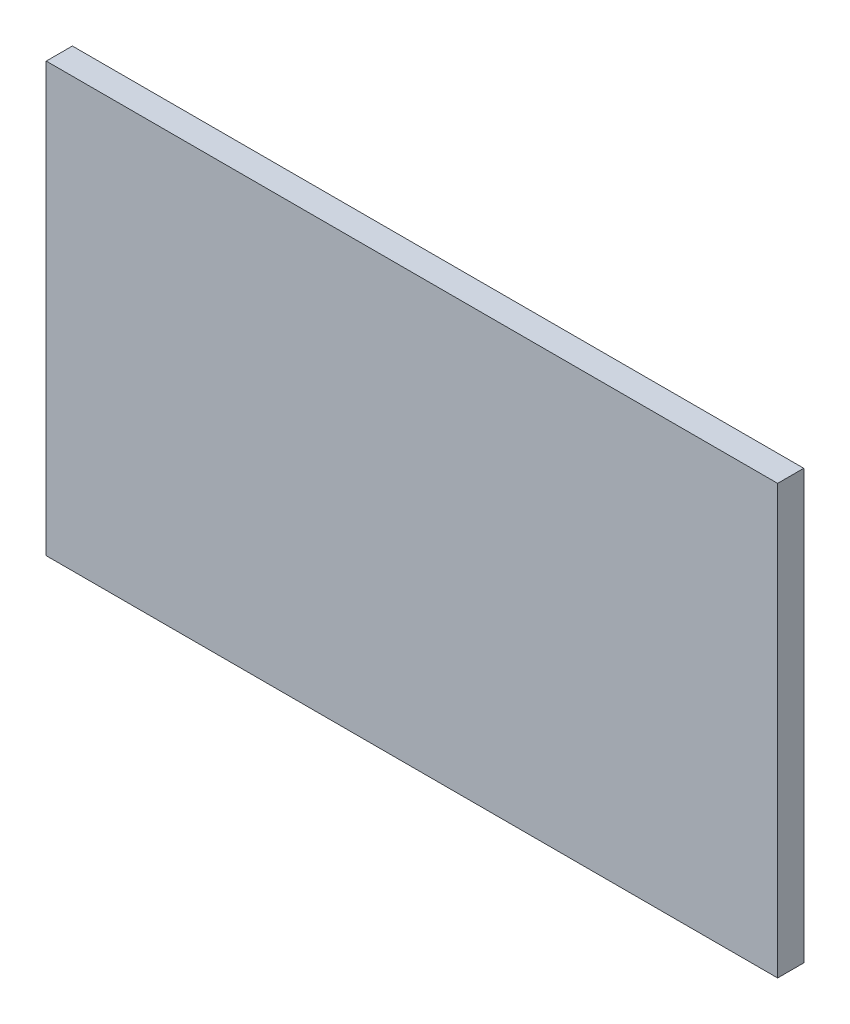
ISO-10303-21;
HEADER;
FILE_DESCRIPTION(('STEP AP214'),'2;1');
FILE_NAME('part.step','',(''),(''),'','','');
FILE_SCHEMA(('AUTOMOTIVE_DESIGN { 1 0 10303 214 1 1 1 1 }'));
ENDSEC;
DATA;
#1=APPLICATION_CONTEXT('core data for automotive mechanical design processes');
#2=APPLICATION_PROTOCOL_DEFINITION('international standard','automotive_design',2000,#1);
#3=PRODUCT_CONTEXT('',#1,'mechanical');
#4=PRODUCT('Part','Part','',(#3));
#5=PRODUCT_RELATED_PRODUCT_CATEGORY('part','',(#4));
#6=PRODUCT_DEFINITION_FORMATION('','',#4);
#7=PRODUCT_DEFINITION_CONTEXT('part definition',#1,'design');
#8=PRODUCT_DEFINITION('design','',#6,#7);
#9=PRODUCT_DEFINITION_SHAPE('','',#8);
#10=(LENGTH_UNIT() NAMED_UNIT(*) SI_UNIT(.MILLI.,.METRE.));
#11=(NAMED_UNIT(*) PLANE_ANGLE_UNIT() SI_UNIT($,.RADIAN.));
#12=(NAMED_UNIT(*) SI_UNIT($,.STERADIAN.) SOLID_ANGLE_UNIT());
#13=UNCERTAINTY_MEASURE_WITH_UNIT(LENGTH_MEASURE(1.E-05),#10,'distance_accuracy_value','');
#14=(GEOMETRIC_REPRESENTATION_CONTEXT(3) GLOBAL_UNCERTAINTY_ASSIGNED_CONTEXT((#13)) GLOBAL_UNIT_ASSIGNED_CONTEXT((#10,
#11,#12)) REPRESENTATION_CONTEXT('',''));
#15=CARTESIAN_POINT('',(0.,0.,0.));
#16=DIRECTION('',(0.,0.,1.));
#17=DIRECTION('',(1.,0.,0.));
#18=AXIS2_PLACEMENT_3D('',#15,#16,#17);
#19=CARTESIAN_POINT('',(0.,0.,3.175));
#20=DIRECTION('',(1.,0.,0.));
#21=DIRECTION('',(0.,1.,0.));
#22=AXIS2_PLACEMENT_3D('',#19,#20,#21);
#23=PLANE('',#22);
#24=DIRECTION('',(0.,-1.,0.));
#25=VECTOR('',#24,1.);
#26=CARTESIAN_POINT('',(0.,0.,0.));
#27=LINE('',#26,#25);
#28=CARTESIAN_POINT('',(0.,52.07,0.));
#29=VERTEX_POINT('',#28);
#30=CARTESIAN_POINT('',(0.,0.,0.));
#31=VERTEX_POINT('',#30);
#32=EDGE_CURVE('E107',#29,#31,#27,.T.);
#33=ORIENTED_EDGE('',*,*,#32,.T.);
#34=DIRECTION('',(0.,0.,-1.));
#35=VECTOR('',#34,1.);
#36=CARTESIAN_POINT('',(0.,0.,3.175));
#37=LINE('',#36,#35);
#38=CARTESIAN_POINT('',(0.,0.,3.175));
#39=VERTEX_POINT('',#38);
#40=EDGE_CURVE('E11',#39,#31,#37,.T.);
#41=ORIENTED_EDGE('',*,*,#40,.F.);
#42=DIRECTION('',(0.,-1.,0.));
#43=VECTOR('',#42,1.);
#44=CARTESIAN_POINT('',(0.,0.,3.175));
#45=LINE('',#44,#43);
#46=CARTESIAN_POINT('',(0.,52.07,3.175));
#47=VERTEX_POINT('',#46);
#48=EDGE_CURVE('E91',#47,#39,#45,.T.);
#49=ORIENTED_EDGE('',*,*,#48,.F.);
#50=DIRECTION('',(0.,0.,-1.));
#51=VECTOR('',#50,1.);
#52=CARTESIAN_POINT('',(0.,52.07,3.175));
#53=LINE('',#52,#51);
#54=EDGE_CURVE('E103',#47,#29,#53,.T.);
#55=ORIENTED_EDGE('',*,*,#54,.T.);
#56=EDGE_LOOP('',(#33,#41,#49,#55));
#57=FACE_BOUND('',#56,.T.);
#58=ADVANCED_FACE('F39',(#57),#23,.F.);
#59=CARTESIAN_POINT('',(0.,0.,3.175));
#60=DIRECTION('',(0.,1.,0.));
#61=DIRECTION('',(0.,0.,1.));
#62=AXIS2_PLACEMENT_3D('',#59,#60,#61);
#63=PLANE('',#62);
#64=DIRECTION('',(1.,0.,0.));
#65=VECTOR('',#64,1.);
#66=CARTESIAN_POINT('',(0.,0.,0.));
#67=LINE('',#66,#65);
#68=CARTESIAN_POINT('',(88.9,0.,0.));
#69=VERTEX_POINT('',#68);
#70=EDGE_CURVE('E96',#31,#69,#67,.T.);
#71=ORIENTED_EDGE('',*,*,#70,.T.);
#72=DIRECTION('',(0.,0.,-1.));
#73=VECTOR('',#72,1.);
#74=CARTESIAN_POINT('',(88.9,0.,3.175));
#75=LINE('',#74,#73);
#76=CARTESIAN_POINT('',(88.9,0.,3.175));
#77=VERTEX_POINT('',#76);
#78=EDGE_CURVE('E48',#77,#69,#75,.T.);
#79=ORIENTED_EDGE('',*,*,#78,.F.);
#80=DIRECTION('',(1.,0.,0.));
#81=VECTOR('',#80,1.);
#82=CARTESIAN_POINT('',(0.,0.,3.175));
#83=LINE('',#82,#81);
#84=EDGE_CURVE('E86',#39,#77,#83,.T.);
#85=ORIENTED_EDGE('',*,*,#84,.F.);
#86=ORIENTED_EDGE('',*,*,#40,.T.);
#87=EDGE_LOOP('',(#71,#79,#85,#86));
#88=FACE_BOUND('',#87,.T.);
#89=ADVANCED_FACE('F95',(#88),#63,.F.);
#90=CARTESIAN_POINT('',(88.9,0.,3.175));
#91=DIRECTION('',(-1.,0.,0.));
#92=DIRECTION('',(0.,-1.,0.));
#93=AXIS2_PLACEMENT_3D('',#90,#91,#92);
#94=PLANE('',#93);
#95=DIRECTION('',(0.,1.,0.));
#96=VECTOR('',#95,1.);
#97=CARTESIAN_POINT('',(88.9,0.,0.));
#98=LINE('',#97,#96);
#99=CARTESIAN_POINT('',(88.9,52.07,0.));
#100=VERTEX_POINT('',#99);
#101=EDGE_CURVE('E73',#69,#100,#98,.T.);
#102=ORIENTED_EDGE('',*,*,#101,.T.);
#103=DIRECTION('',(0.,0.,-1.));
#104=VECTOR('',#103,1.);
#105=CARTESIAN_POINT('',(88.9,52.07,3.175));
#106=LINE('',#105,#104);
#107=CARTESIAN_POINT('',(88.9,52.07,3.175));
#108=VERTEX_POINT('',#107);
#109=EDGE_CURVE('E98',#108,#100,#106,.T.);
#110=ORIENTED_EDGE('',*,*,#109,.F.);
#111=DIRECTION('',(0.,1.,0.));
#112=VECTOR('',#111,1.);
#113=CARTESIAN_POINT('',(88.9,0.,3.175));
#114=LINE('',#113,#112);
#115=EDGE_CURVE('E89',#77,#108,#114,.T.);
#116=ORIENTED_EDGE('',*,*,#115,.F.);
#117=ORIENTED_EDGE('',*,*,#78,.T.);
#118=EDGE_LOOP('',(#102,#110,#116,#117));
#119=FACE_BOUND('',#118,.T.);
#120=ADVANCED_FACE('F99',(#119),#94,.F.);
#121=CARTESIAN_POINT('',(0.,52.07,3.175));
#122=DIRECTION('',(0.,-1.,0.));
#123=DIRECTION('',(0.,0.,-1.));
#124=AXIS2_PLACEMENT_3D('',#121,#122,#123);
#125=PLANE('',#124);
#126=DIRECTION('',(-1.,0.,0.));
#127=VECTOR('',#126,1.);
#128=CARTESIAN_POINT('',(0.,52.07,0.));
#129=LINE('',#128,#127);
#130=EDGE_CURVE('E79',#100,#29,#129,.T.);
#131=ORIENTED_EDGE('',*,*,#130,.T.);
#132=ORIENTED_EDGE('',*,*,#54,.F.);
#133=DIRECTION('',(-1.,0.,0.));
#134=VECTOR('',#133,1.);
#135=CARTESIAN_POINT('',(0.,52.07,3.175));
#136=LINE('',#135,#134);
#137=EDGE_CURVE('E56',#108,#47,#136,.T.);
#138=ORIENTED_EDGE('',*,*,#137,.F.);
#139=ORIENTED_EDGE('',*,*,#109,.T.);
#140=EDGE_LOOP('',(#131,#132,#138,#139));
#141=FACE_BOUND('',#140,.T.);
#142=ADVANCED_FACE('F120',(#141),#125,.F.);
#143=CARTESIAN_POINT('',(0.,0.,3.175));
#144=DIRECTION('',(0.,0.,-1.));
#145=DIRECTION('',(-1.,0.,0.));
#146=AXIS2_PLACEMENT_3D('',#143,#144,#145);
#147=PLANE('',#146);
#148=ORIENTED_EDGE('',*,*,#48,.T.);
#149=ORIENTED_EDGE('',*,*,#84,.T.);
#150=ORIENTED_EDGE('',*,*,#115,.T.);
#151=ORIENTED_EDGE('',*,*,#137,.T.);
#152=EDGE_LOOP('',(#148,#149,#150,#151));
#153=FACE_BOUND('',#152,.T.);
#154=ADVANCED_FACE('F87',(#153),#147,.F.);
#155=CARTESIAN_POINT('',(0.,0.,0.));
#156=DIRECTION('',(0.,0.,-1.));
#157=DIRECTION('',(-1.,0.,0.));
#158=AXIS2_PLACEMENT_3D('',#155,#156,#157);
#159=PLANE('',#158);
#160=ORIENTED_EDGE('',*,*,#32,.F.);
#161=ORIENTED_EDGE('',*,*,#130,.F.);
#162=ORIENTED_EDGE('',*,*,#101,.F.);
#163=ORIENTED_EDGE('',*,*,#70,.F.);
#164=EDGE_LOOP('',(#160,#161,#162,#163));
#165=FACE_BOUND('',#164,.T.);
#166=ADVANCED_FACE('F123',(#165),#159,.T.);
#167=CLOSED_SHELL('',(#58,#89,#120,#142,#154,#166));
#168=MANIFOLD_SOLID_BREP('B2',#167);
#169=ADVANCED_BREP_SHAPE_REPRESENTATION('',(#18,#168),#14);
#170=SHAPE_DEFINITION_REPRESENTATION(#9,#169);
ENDSEC;
END-ISO-10303-21;
